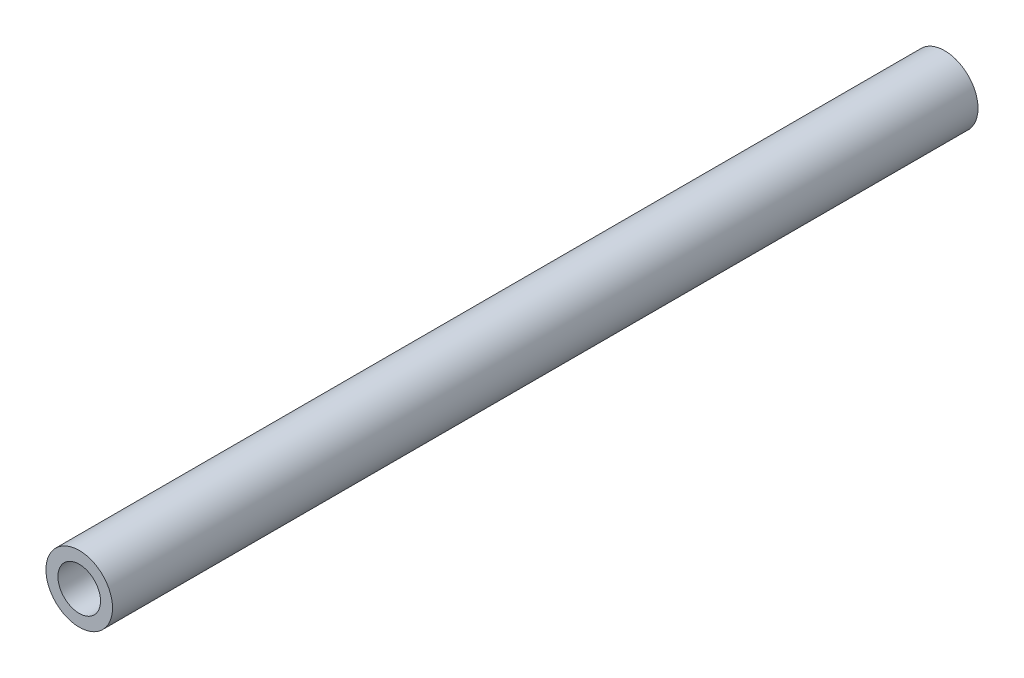
ISO-10303-21;
HEADER;
FILE_DESCRIPTION(('STEP AP214'),'2;1');
FILE_NAME('part.step','',(''),(''),'','','');
FILE_SCHEMA(('AUTOMOTIVE_DESIGN { 1 0 10303 214 1 1 1 1 }'));
ENDSEC;
DATA;
#1=APPLICATION_CONTEXT('core data for automotive mechanical design processes');
#2=APPLICATION_PROTOCOL_DEFINITION('international standard','automotive_design',2000,#1);
#3=PRODUCT_CONTEXT('',#1,'mechanical');
#4=PRODUCT('Part','Part','',(#3));
#5=PRODUCT_RELATED_PRODUCT_CATEGORY('part','',(#4));
#6=PRODUCT_DEFINITION_FORMATION('','',#4);
#7=PRODUCT_DEFINITION_CONTEXT('part definition',#1,'design');
#8=PRODUCT_DEFINITION('design','',#6,#7);
#9=PRODUCT_DEFINITION_SHAPE('','',#8);
#10=(LENGTH_UNIT() NAMED_UNIT(*) SI_UNIT(.MILLI.,.METRE.));
#11=(NAMED_UNIT(*) PLANE_ANGLE_UNIT() SI_UNIT($,.RADIAN.));
#12=(NAMED_UNIT(*) SI_UNIT($,.STERADIAN.) SOLID_ANGLE_UNIT());
#13=UNCERTAINTY_MEASURE_WITH_UNIT(LENGTH_MEASURE(1.E-05),#10,'distance_accuracy_value','');
#14=(GEOMETRIC_REPRESENTATION_CONTEXT(3) GLOBAL_UNCERTAINTY_ASSIGNED_CONTEXT((#13)) GLOBAL_UNIT_ASSIGNED_CONTEXT((#10,
#11,#12)) REPRESENTATION_CONTEXT('',''));
#15=CARTESIAN_POINT('',(0.,0.,0.));
#16=DIRECTION('',(0.,0.,1.));
#17=DIRECTION('',(1.,0.,0.));
#18=AXIS2_PLACEMENT_3D('',#15,#16,#17);
#19=CARTESIAN_POINT('',(0.,0.,65.));
#20=DIRECTION('',(0.,0.,1.));
#21=DIRECTION('',(1.,0.,0.));
#22=AXIS2_PLACEMENT_3D('',#19,#20,#21);
#23=PLANE('',#22);
#24=CARTESIAN_POINT('',(0.,0.,65.));
#25=DIRECTION('',(0.,0.,1.));
#26=DIRECTION('',(1.,0.,0.));
#27=AXIS2_PLACEMENT_3D('',#24,#25,#26);
#28=CIRCLE('',#27,2.5);
#29=CARTESIAN_POINT('',(2.5,0.,65.));
#30=VERTEX_POINT('',#29);
#31=EDGE_CURVE('E10',#30,#30,#28,.T.);
#32=ORIENTED_EDGE('',*,*,#31,.T.);
#33=EDGE_LOOP('',(#32));
#34=FACE_BOUND('',#33,.T.);
#35=CARTESIAN_POINT('',(0.,0.,65.));
#36=DIRECTION('',(0.,0.,1.));
#37=DIRECTION('',(1.,0.,0.));
#38=AXIS2_PLACEMENT_3D('',#35,#36,#37);
#39=CIRCLE('',#38,1.6);
#40=CARTESIAN_POINT('',(1.6,0.,65.));
#41=VERTEX_POINT('',#40);
#42=EDGE_CURVE('E42',#41,#41,#39,.T.);
#43=ORIENTED_EDGE('',*,*,#42,.F.);
#44=EDGE_LOOP('',(#43));
#45=FACE_BOUND('',#44,.T.);
#46=ADVANCED_FACE('F31',(#34,#45),#23,.T.);
#47=CARTESIAN_POINT('',(0.,0.,0.));
#48=DIRECTION('',(0.,0.,1.));
#49=DIRECTION('',(1.,0.,0.));
#50=AXIS2_PLACEMENT_3D('',#47,#48,#49);
#51=PLANE('',#50);
#52=CARTESIAN_POINT('',(0.,0.,0.));
#53=DIRECTION('',(0.,0.,1.));
#54=DIRECTION('',(1.,0.,0.));
#55=AXIS2_PLACEMENT_3D('',#52,#53,#54);
#56=CIRCLE('',#55,2.5);
#57=CARTESIAN_POINT('',(2.5,0.,0.));
#58=VERTEX_POINT('',#57);
#59=EDGE_CURVE('E35',#58,#58,#56,.T.);
#60=ORIENTED_EDGE('',*,*,#59,.F.);
#61=EDGE_LOOP('',(#60));
#62=FACE_BOUND('',#61,.T.);
#63=CARTESIAN_POINT('',(0.,0.,0.));
#64=DIRECTION('',(0.,0.,1.));
#65=DIRECTION('',(1.,0.,0.));
#66=AXIS2_PLACEMENT_3D('',#63,#64,#65);
#67=CIRCLE('',#66,1.6);
#68=CARTESIAN_POINT('',(1.6,0.,0.));
#69=VERTEX_POINT('',#68);
#70=EDGE_CURVE('E44',#69,#69,#67,.T.);
#71=ORIENTED_EDGE('',*,*,#70,.T.);
#72=EDGE_LOOP('',(#71));
#73=FACE_BOUND('',#72,.T.);
#74=ADVANCED_FACE('F54',(#62,#73),#51,.F.);
#75=CARTESIAN_POINT('',(0.,0.,65.));
#76=DIRECTION('',(0.,0.,-1.));
#77=DIRECTION('',(-1.,0.,0.));
#78=AXIS2_PLACEMENT_3D('',#75,#76,#77);
#79=CYLINDRICAL_SURFACE('',#78,2.5);
#80=ORIENTED_EDGE('',*,*,#31,.F.);
#81=EDGE_LOOP('',(#80));
#82=FACE_BOUND('',#81,.T.);
#83=ORIENTED_EDGE('',*,*,#59,.T.);
#84=EDGE_LOOP('',(#83));
#85=FACE_BOUND('',#84,.T.);
#86=ADVANCED_FACE('F33',(#82,#85),#79,.T.);
#87=CARTESIAN_POINT('',(0.,0.,65.));
#88=DIRECTION('',(0.,0.,-1.));
#89=DIRECTION('',(-1.,0.,0.));
#90=AXIS2_PLACEMENT_3D('',#87,#88,#89);
#91=CYLINDRICAL_SURFACE('',#90,1.6);
#92=ORIENTED_EDGE('',*,*,#42,.T.);
#93=EDGE_LOOP('',(#92));
#94=FACE_BOUND('',#93,.T.);
#95=ORIENTED_EDGE('',*,*,#70,.F.);
#96=EDGE_LOOP('',(#95));
#97=FACE_BOUND('',#96,.T.);
#98=ADVANCED_FACE('F50',(#94,#97),#91,.F.);
#99=CLOSED_SHELL('',(#46,#74,#86,#98));
#100=MANIFOLD_SOLID_BREP('B2',#99);
#101=ADVANCED_BREP_SHAPE_REPRESENTATION('',(#18,#100),#14);
#102=SHAPE_DEFINITION_REPRESENTATION(#9,#101);
ENDSEC;
END-ISO-10303-21;
